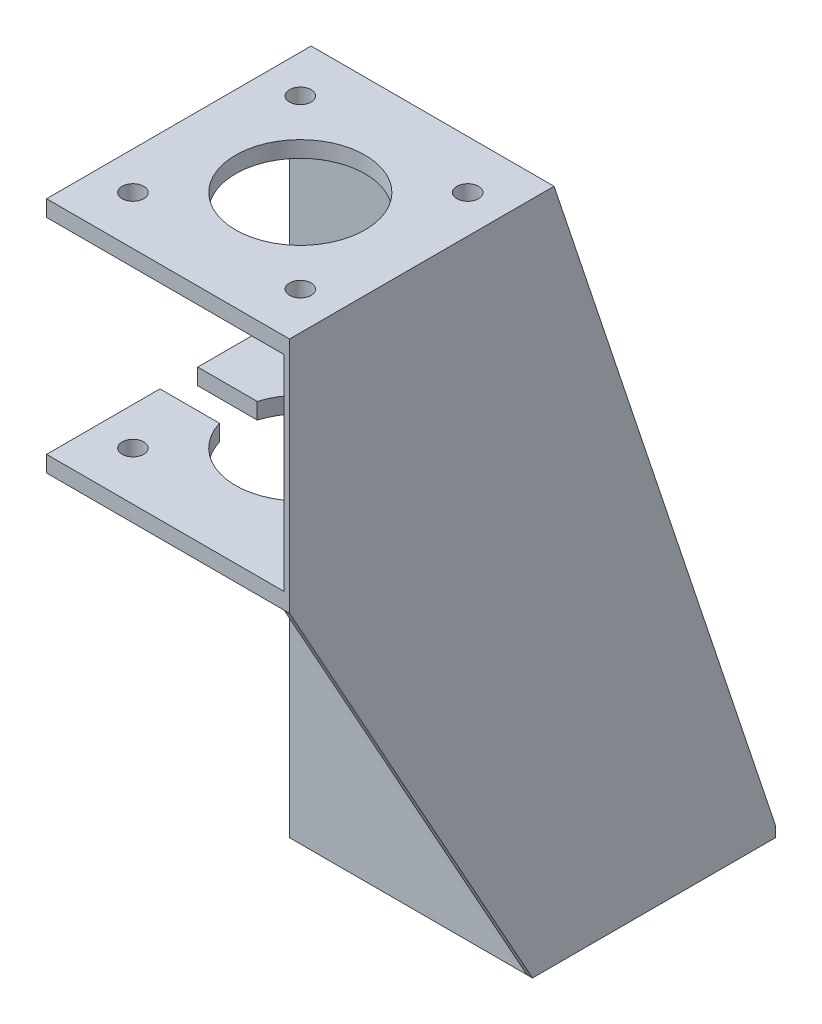
ISO-10303-21;
HEADER;
FILE_DESCRIPTION(('STEP AP214'),'2;1');
FILE_NAME('part.step','',(''),(''),'','','');
FILE_SCHEMA(('AUTOMOTIVE_DESIGN { 1 0 10303 214 1 1 1 1 }'));
ENDSEC;
DATA;
#1=APPLICATION_CONTEXT('core data for automotive mechanical design processes');
#2=APPLICATION_PROTOCOL_DEFINITION('international standard','automotive_design',2000,#1);
#3=PRODUCT_CONTEXT('',#1,'mechanical');
#4=PRODUCT('Part','Part','',(#3));
#5=PRODUCT_RELATED_PRODUCT_CATEGORY('part','',(#4));
#6=PRODUCT_DEFINITION_FORMATION('','',#4);
#7=PRODUCT_DEFINITION_CONTEXT('part definition',#1,'design');
#8=PRODUCT_DEFINITION('design','',#6,#7);
#9=PRODUCT_DEFINITION_SHAPE('','',#8);
#10=(LENGTH_UNIT() NAMED_UNIT(*) SI_UNIT(.MILLI.,.METRE.));
#11=(NAMED_UNIT(*) PLANE_ANGLE_UNIT() SI_UNIT($,.RADIAN.));
#12=(NAMED_UNIT(*) SI_UNIT($,.STERADIAN.) SOLID_ANGLE_UNIT());
#13=UNCERTAINTY_MEASURE_WITH_UNIT(LENGTH_MEASURE(1.E-05),#10,'distance_accuracy_value','');
#14=(GEOMETRIC_REPRESENTATION_CONTEXT(3) GLOBAL_UNCERTAINTY_ASSIGNED_CONTEXT((#13)) GLOBAL_UNIT_ASSIGNED_CONTEXT((#10,
#11,#12)) REPRESENTATION_CONTEXT('',''));
#15=CARTESIAN_POINT('',(0.,0.,0.));
#16=DIRECTION('',(0.,0.,1.));
#17=DIRECTION('',(1.,0.,0.));
#18=AXIS2_PLACEMENT_3D('',#15,#16,#17);
#19=CARTESIAN_POINT('',(-22.5,84.,67.5));
#20=DIRECTION('',(0.,-1.,0.));
#21=DIRECTION('',(0.,0.,-1.));
#22=AXIS2_PLACEMENT_3D('',#19,#20,#21);
#23=PLANE('',#22);
#24=CARTESIAN_POINT('',(-15.5,84.,58.5));
#25=DIRECTION('',(0.,-1.,0.));
#26=DIRECTION('',(0.,0.,-1.));
#27=AXIS2_PLACEMENT_3D('',#24,#25,#26);
#28=CIRCLE('',#27,2.);
#29=CARTESIAN_POINT('',(-15.5,84.,56.5));
#30=VERTEX_POINT('',#29);
#31=EDGE_CURVE('E619',#30,#30,#28,.T.);
#32=ORIENTED_EDGE('',*,*,#31,.T.);
#33=EDGE_LOOP('',(#32));
#34=FACE_BOUND('',#33,.T.);
#35=CARTESIAN_POINT('',(-15.5,84.,27.5));
#36=DIRECTION('',(0.,-1.,0.));
#37=DIRECTION('',(0.,0.,-1.));
#38=AXIS2_PLACEMENT_3D('',#35,#36,#37);
#39=CIRCLE('',#38,2.);
#40=CARTESIAN_POINT('',(-15.5,84.,25.5));
#41=VERTEX_POINT('',#40);
#42=EDGE_CURVE('E623',#41,#41,#39,.T.);
#43=ORIENTED_EDGE('',*,*,#42,.T.);
#44=EDGE_LOOP('',(#43));
#45=FACE_BOUND('',#44,.T.);
#46=CARTESIAN_POINT('',(15.5,84.,27.5));
#47=DIRECTION('',(0.,-1.,0.));
#48=DIRECTION('',(0.,0.,-1.));
#49=AXIS2_PLACEMENT_3D('',#46,#47,#48);
#50=CIRCLE('',#49,2.);
#51=CARTESIAN_POINT('',(15.5,84.,25.5));
#52=VERTEX_POINT('',#51);
#53=EDGE_CURVE('E627',#52,#52,#50,.T.);
#54=ORIENTED_EDGE('',*,*,#53,.T.);
#55=EDGE_LOOP('',(#54));
#56=FACE_BOUND('',#55,.T.);
#57=CARTESIAN_POINT('',(15.5,84.,58.5));
#58=DIRECTION('',(0.,-1.,0.));
#59=DIRECTION('',(0.,0.,-1.));
#60=AXIS2_PLACEMENT_3D('',#57,#58,#59);
#61=CIRCLE('',#60,2.00000000000001);
#62=CARTESIAN_POINT('',(15.5,84.,56.5));
#63=VERTEX_POINT('',#62);
#64=EDGE_CURVE('E630',#63,#63,#61,.T.);
#65=ORIENTED_EDGE('',*,*,#64,.T.);
#66=EDGE_LOOP('',(#65));
#67=FACE_BOUND('',#66,.T.);
#68=DIRECTION('',(0.,0.,-1.));
#69=VECTOR('',#68,1.);
#70=CARTESIAN_POINT('',(21.5,84.,67.5));
#71=LINE('',#70,#69);
#72=CARTESIAN_POINT('',(21.5,84.,67.5));
#73=VERTEX_POINT('',#72);
#74=CARTESIAN_POINT('',(21.5,84.,22.5));
#75=VERTEX_POINT('',#74);
#76=EDGE_CURVE('E62',#73,#75,#71,.T.);
#77=ORIENTED_EDGE('',*,*,#76,.T.);
#78=DIRECTION('',(-1.,0.,0.));
#79=VECTOR('',#78,1.);
#80=CARTESIAN_POINT('',(-22.5,84.,22.5));
#81=LINE('',#80,#79);
#82=CARTESIAN_POINT('',(-22.5,84.,22.5));
#83=VERTEX_POINT('',#82);
#84=EDGE_CURVE('E249',#75,#83,#81,.T.);
#85=ORIENTED_EDGE('',*,*,#84,.T.);
#86=DIRECTION('',(0.,0.,-1.));
#87=VECTOR('',#86,1.);
#88=CARTESIAN_POINT('',(-22.5,84.,67.5));
#89=LINE('',#88,#87);
#90=CARTESIAN_POINT('',(-22.5,84.,39.5));
#91=VERTEX_POINT('',#90);
#92=EDGE_CURVE('E247',#91,#83,#89,.T.);
#93=ORIENTED_EDGE('',*,*,#92,.F.);
#94=DIRECTION('',(1.,0.,0.));
#95=VECTOR('',#94,1.);
#96=CARTESIAN_POINT('',(-36.4498340359898,84.,39.5));
#97=LINE('',#96,#95);
#98=CARTESIAN_POINT('',(-11.478240283249,84.,39.5));
#99=VERTEX_POINT('',#98);
#100=EDGE_CURVE('E603',#91,#99,#97,.T.);
#101=ORIENTED_EDGE('',*,*,#100,.T.);
#102=CARTESIAN_POINT('',(0.,84.,43.));
#103=DIRECTION('',(0.,-1.,0.));
#104=DIRECTION('',(0.,0.,-1.));
#105=AXIS2_PLACEMENT_3D('',#102,#103,#104);
#106=CIRCLE('',#105,12.);
#107=CARTESIAN_POINT('',(-11.478240283249,84.,46.5));
#108=VERTEX_POINT('',#107);
#109=EDGE_CURVE('E254',#99,#108,#106,.T.);
#110=ORIENTED_EDGE('',*,*,#109,.T.);
#111=DIRECTION('',(1.,0.,0.));
#112=VECTOR('',#111,1.);
#113=CARTESIAN_POINT('',(-36.4498340359898,84.,46.5));
#114=LINE('',#113,#112);
#115=CARTESIAN_POINT('',(-22.5,84.,46.5));
#116=VERTEX_POINT('',#115);
#117=EDGE_CURVE('E597',#116,#108,#114,.T.);
#118=ORIENTED_EDGE('',*,*,#117,.F.);
#119=CARTESIAN_POINT('',(-22.5,84.,67.5));
#120=VERTEX_POINT('',#119);
#121=EDGE_CURVE('E256',#120,#116,#89,.T.);
#122=ORIENTED_EDGE('',*,*,#121,.F.);
#123=DIRECTION('',(-1.,0.,0.));
#124=VECTOR('',#123,1.);
#125=CARTESIAN_POINT('',(-22.5,84.,67.5));
#126=LINE('',#125,#124);
#127=EDGE_CURVE('E245',#73,#120,#126,.T.);
#128=ORIENTED_EDGE('',*,*,#127,.F.);
#129=EDGE_LOOP('',(#77,#85,#93,#101,#110,#118,#122,#128));
#130=FACE_BOUND('',#129,.T.);
#131=ADVANCED_FACE('F37',(#34,#45,#56,#67,#130),#23,.F.);
#132=CARTESIAN_POINT('',(-22.5,2.,22.5));
#133=DIRECTION('',(0.,0.,-1.));
#134=DIRECTION('',(-1.,0.,0.));
#135=AXIS2_PLACEMENT_3D('',#132,#133,#134);
#136=PLANE('',#135);
#137=DIRECTION('',(0.,-1.,0.));
#138=VECTOR('',#137,1.);
#139=CARTESIAN_POINT('',(21.5,2.,22.5));
#140=LINE('',#139,#138);
#141=CARTESIAN_POINT('',(21.5,122.,22.5));
#142=VERTEX_POINT('',#141);
#143=EDGE_CURVE('E595',#142,#75,#140,.T.);
#144=ORIENTED_EDGE('',*,*,#143,.F.);
#145=DIRECTION('',(1.,0.,0.));
#146=VECTOR('',#145,1.);
#147=CARTESIAN_POINT('',(-22.5,122.,22.5));
#148=LINE('',#147,#146);
#149=CARTESIAN_POINT('',(-22.5,122.,22.5));
#150=VERTEX_POINT('',#149);
#151=EDGE_CURVE('E292',#150,#142,#148,.T.);
#152=ORIENTED_EDGE('',*,*,#151,.F.);
#153=DIRECTION('',(0.,-1.,0.));
#154=VECTOR('',#153,1.);
#155=CARTESIAN_POINT('',(-22.5,2.,22.5));
#156=LINE('',#155,#154);
#157=EDGE_CURVE('E312',#150,#83,#156,.T.);
#158=ORIENTED_EDGE('',*,*,#157,.T.);
#159=ORIENTED_EDGE('',*,*,#84,.F.);
#160=EDGE_LOOP('',(#144,#152,#158,#159));
#161=FACE_BOUND('',#160,.T.);
#162=ADVANCED_FACE('F490',(#161),#136,.F.);
#163=CARTESIAN_POINT('',(-22.5,122.,67.5));
#164=DIRECTION('',(0.,1.,0.));
#165=DIRECTION('',(0.,0.,1.));
#166=AXIS2_PLACEMENT_3D('',#163,#164,#165);
#167=PLANE('',#166);
#168=CARTESIAN_POINT('',(-15.5,122.,27.5));
#169=DIRECTION('',(0.,1.,0.));
#170=DIRECTION('',(0.,0.,1.));
#171=AXIS2_PLACEMENT_3D('',#168,#169,#170);
#172=CIRCLE('',#171,2.);
#173=CARTESIAN_POINT('',(-15.5,122.,29.5));
#174=VERTEX_POINT('',#173);
#175=EDGE_CURVE('E289',#174,#174,#172,.F.);
#176=ORIENTED_EDGE('',*,*,#175,.F.);
#177=EDGE_LOOP('',(#176));
#178=FACE_BOUND('',#177,.T.);
#179=CARTESIAN_POINT('',(-15.5,122.,58.5));
#180=DIRECTION('',(0.,1.,0.));
#181=DIRECTION('',(0.,0.,1.));
#182=AXIS2_PLACEMENT_3D('',#179,#180,#181);
#183=CIRCLE('',#182,2.);
#184=CARTESIAN_POINT('',(-15.5,122.,60.5));
#185=VERTEX_POINT('',#184);
#186=EDGE_CURVE('E280',#185,#185,#183,.F.);
#187=ORIENTED_EDGE('',*,*,#186,.F.);
#188=EDGE_LOOP('',(#187));
#189=FACE_BOUND('',#188,.T.);
#190=CARTESIAN_POINT('',(0.,122.,43.));
#191=DIRECTION('',(0.,1.,0.));
#192=DIRECTION('',(0.,0.,1.));
#193=AXIS2_PLACEMENT_3D('',#190,#191,#192);
#194=CIRCLE('',#193,12.);
#195=CARTESIAN_POINT('',(0.,122.,55.));
#196=VERTEX_POINT('',#195);
#197=EDGE_CURVE('E274',#196,#196,#194,.F.);
#198=ORIENTED_EDGE('',*,*,#197,.F.);
#199=EDGE_LOOP('',(#198));
#200=FACE_BOUND('',#199,.T.);
#201=CARTESIAN_POINT('',(15.5,122.,58.5));
#202=DIRECTION('',(0.,1.,0.));
#203=DIRECTION('',(0.,0.,1.));
#204=AXIS2_PLACEMENT_3D('',#201,#202,#203);
#205=CIRCLE('',#204,2.);
#206=CARTESIAN_POINT('',(15.5,122.,60.5));
#207=VERTEX_POINT('',#206);
#208=EDGE_CURVE('E268',#207,#207,#205,.F.);
#209=ORIENTED_EDGE('',*,*,#208,.F.);
#210=EDGE_LOOP('',(#209));
#211=FACE_BOUND('',#210,.T.);
#212=CARTESIAN_POINT('',(15.5,122.,27.5));
#213=DIRECTION('',(0.,1.,0.));
#214=DIRECTION('',(0.,0.,1.));
#215=AXIS2_PLACEMENT_3D('',#212,#213,#214);
#216=CIRCLE('',#215,2.);
#217=CARTESIAN_POINT('',(15.5,122.,29.5));
#218=VERTEX_POINT('',#217);
#219=EDGE_CURVE('E262',#218,#218,#216,.F.);
#220=ORIENTED_EDGE('',*,*,#219,.F.);
#221=EDGE_LOOP('',(#220));
#222=FACE_BOUND('',#221,.T.);
#223=DIRECTION('',(0.,0.,-1.));
#224=VECTOR('',#223,1.);
#225=CARTESIAN_POINT('',(21.5,122.,67.5));
#226=LINE('',#225,#224);
#227=CARTESIAN_POINT('',(21.5,122.,67.5));
#228=VERTEX_POINT('',#227);
#229=EDGE_CURVE('E593',#228,#142,#226,.T.);
#230=ORIENTED_EDGE('',*,*,#229,.F.);
#231=DIRECTION('',(1.,0.,0.));
#232=VECTOR('',#231,1.);
#233=CARTESIAN_POINT('',(-22.5,122.,67.5));
#234=LINE('',#233,#232);
#235=CARTESIAN_POINT('',(-22.5,122.,67.5));
#236=VERTEX_POINT('',#235);
#237=EDGE_CURVE('E296',#236,#228,#234,.T.);
#238=ORIENTED_EDGE('',*,*,#237,.F.);
#239=DIRECTION('',(0.,0.,-1.));
#240=VECTOR('',#239,1.);
#241=CARTESIAN_POINT('',(-22.5,122.,67.5));
#242=LINE('',#241,#240);
#243=EDGE_CURVE('E303',#236,#150,#242,.T.);
#244=ORIENTED_EDGE('',*,*,#243,.T.);
#245=ORIENTED_EDGE('',*,*,#151,.T.);
#246=EDGE_LOOP('',(#230,#238,#244,#245));
#247=FACE_BOUND('',#246,.T.);
#248=ADVANCED_FACE('F496',(#178,#189,#200,#211,#222,#247),#167,.F.);
#249=CARTESIAN_POINT('',(-22.5,2.,-22.5));
#250=DIRECTION('',(1.,0.,0.));
#251=DIRECTION('',(0.,0.,-1.));
#252=AXIS2_PLACEMENT_3D('',#249,#250,#251);
#253=PLANE('',#252);
#254=DIRECTION('',(0.,-1.,0.));
#255=VECTOR('',#254,1.);
#256=CARTESIAN_POINT('',(-22.5,2.,39.5));
#257=LINE('',#256,#255);
#258=CARTESIAN_POINT('',(-22.5,81.,39.5));
#259=VERTEX_POINT('',#258);
#260=EDGE_CURVE('E614',#91,#259,#257,.T.);
#261=ORIENTED_EDGE('',*,*,#260,.F.);
#262=ORIENTED_EDGE('',*,*,#92,.T.);
#263=ORIENTED_EDGE('',*,*,#157,.F.);
#264=ORIENTED_EDGE('',*,*,#243,.F.);
#265=DIRECTION('',(0.,-1.,0.));
#266=VECTOR('',#265,1.);
#267=CARTESIAN_POINT('',(-22.5,125.,67.5));
#268=LINE('',#267,#266);
#269=CARTESIAN_POINT('',(-22.5,125.,67.5));
#270=VERTEX_POINT('',#269);
#271=EDGE_CURVE('E293',#270,#236,#268,.T.);
#272=ORIENTED_EDGE('',*,*,#271,.F.);
#273=DIRECTION('',(0.,0.,1.));
#274=VECTOR('',#273,1.);
#275=CARTESIAN_POINT('',(-22.5,125.,18.5));
#276=LINE('',#275,#274);
#277=CARTESIAN_POINT('',(-22.5,125.,18.5));
#278=VERTEX_POINT('',#277);
#279=EDGE_CURVE('E389',#278,#270,#276,.T.);
#280=ORIENTED_EDGE('',*,*,#279,.F.);
#281=DIRECTION('',(0.,-1.,0.));
#282=VECTOR('',#281,1.);
#283=CARTESIAN_POINT('',(-22.5,122.,18.5));
#284=LINE('',#283,#282);
#285=CARTESIAN_POINT('',(-22.5,2.,18.5));
#286=VERTEX_POINT('',#285);
#287=EDGE_CURVE('E340',#278,#286,#284,.T.);
#288=ORIENTED_EDGE('',*,*,#287,.T.);
#289=DIRECTION('',(0.,0.,1.));
#290=VECTOR('',#289,1.);
#291=CARTESIAN_POINT('',(-22.5,2.,-22.5));
#292=LINE('',#291,#290);
#293=CARTESIAN_POINT('',(-22.5,2.,-22.5));
#294=VERTEX_POINT('',#293);
#295=EDGE_CURVE('E322',#294,#286,#292,.T.);
#296=ORIENTED_EDGE('',*,*,#295,.F.);
#297=DIRECTION('',(0.,-1.,0.));
#298=VECTOR('',#297,1.);
#299=CARTESIAN_POINT('',(-22.5,2.,-22.5));
#300=LINE('',#299,#298);
#301=CARTESIAN_POINT('',(-22.5,0.,-22.5));
#302=VERTEX_POINT('',#301);
#303=EDGE_CURVE('E329',#294,#302,#300,.T.);
#304=ORIENTED_EDGE('',*,*,#303,.T.);
#305=DIRECTION('',(0.,0.,1.));
#306=VECTOR('',#305,1.);
#307=CARTESIAN_POINT('',(-22.5,0.,-22.5));
#308=LINE('',#307,#306);
#309=CARTESIAN_POINT('',(-22.5,0.,22.5));
#310=VERTEX_POINT('',#309);
#311=EDGE_CURVE('E350',#302,#310,#308,.T.);
#312=ORIENTED_EDGE('',*,*,#311,.T.);
#313=CARTESIAN_POINT('',(-22.5,81.,22.5));
#314=VERTEX_POINT('',#313);
#315=EDGE_CURVE('E320',#314,#310,#156,.T.);
#316=ORIENTED_EDGE('',*,*,#315,.F.);
#317=DIRECTION('',(0.,0.,-1.));
#318=VECTOR('',#317,1.);
#319=CARTESIAN_POINT('',(-22.5,81.,67.5));
#320=LINE('',#319,#318);
#321=EDGE_CURVE('E259',#259,#314,#320,.T.);
#322=ORIENTED_EDGE('',*,*,#321,.F.);
#323=EDGE_LOOP('',(#261,#262,#263,#264,#272,#280,#288,#296,#304,#312,#316,#322));
#324=FACE_BOUND('',#323,.T.);
#325=ADVANCED_FACE('F384',(#324),#253,.F.);
#326=CARTESIAN_POINT('',(-22.5,81.,67.5));
#327=DIRECTION('',(0.,1.,0.));
#328=DIRECTION('',(0.,0.,1.));
#329=AXIS2_PLACEMENT_3D('',#326,#327,#328);
#330=PLANE('',#329);
#331=CARTESIAN_POINT('',(15.5,81.,58.5));
#332=DIRECTION('',(0.,1.,0.));
#333=DIRECTION('',(0.,0.,1.));
#334=AXIS2_PLACEMENT_3D('',#331,#332,#333);
#335=CIRCLE('',#334,2.00000000000001);
#336=CARTESIAN_POINT('',(15.5,81.,60.5));
#337=VERTEX_POINT('',#336);
#338=EDGE_CURVE('E628',#337,#337,#335,.F.);
#339=ORIENTED_EDGE('',*,*,#338,.F.);
#340=EDGE_LOOP('',(#339));
#341=FACE_BOUND('',#340,.T.);
#342=CARTESIAN_POINT('',(15.5,81.,27.5));
#343=DIRECTION('',(0.,1.,0.));
#344=DIRECTION('',(0.,0.,1.));
#345=AXIS2_PLACEMENT_3D('',#342,#343,#344);
#346=CIRCLE('',#345,2.);
#347=CARTESIAN_POINT('',(15.5,81.,29.5));
#348=VERTEX_POINT('',#347);
#349=EDGE_CURVE('E624',#348,#348,#346,.F.);
#350=ORIENTED_EDGE('',*,*,#349,.F.);
#351=EDGE_LOOP('',(#350));
#352=FACE_BOUND('',#351,.T.);
#353=CARTESIAN_POINT('',(-15.5,81.,27.5));
#354=DIRECTION('',(0.,1.,0.));
#355=DIRECTION('',(0.,0.,1.));
#356=AXIS2_PLACEMENT_3D('',#353,#354,#355);
#357=CIRCLE('',#356,2.);
#358=CARTESIAN_POINT('',(-15.5,81.,29.5));
#359=VERTEX_POINT('',#358);
#360=EDGE_CURVE('E620',#359,#359,#357,.F.);
#361=ORIENTED_EDGE('',*,*,#360,.F.);
#362=EDGE_LOOP('',(#361));
#363=FACE_BOUND('',#362,.T.);
#364=CARTESIAN_POINT('',(-15.5,81.,58.5));
#365=DIRECTION('',(0.,1.,0.));
#366=DIRECTION('',(0.,0.,1.));
#367=AXIS2_PLACEMENT_3D('',#364,#365,#366);
#368=CIRCLE('',#367,2.);
#369=CARTESIAN_POINT('',(-15.5,81.,60.5));
#370=VERTEX_POINT('',#369);
#371=EDGE_CURVE('E616',#370,#370,#368,.F.);
#372=ORIENTED_EDGE('',*,*,#371,.F.);
#373=EDGE_LOOP('',(#372));
#374=FACE_BOUND('',#373,.T.);
#375=DIRECTION('',(1.,0.,0.));
#376=VECTOR('',#375,1.);
#377=CARTESIAN_POINT('',(-22.5,81.,22.5));
#378=LINE('',#377,#376);
#379=CARTESIAN_POINT('',(21.5,81.,22.5));
#380=VERTEX_POINT('',#379);
#381=EDGE_CURVE('E238',#314,#380,#378,.T.);
#382=ORIENTED_EDGE('',*,*,#381,.T.);
#383=DIRECTION('',(0.,0.,1.));
#384=VECTOR('',#383,1.);
#385=CARTESIAN_POINT('',(21.5,81.,67.5));
#386=LINE('',#385,#384);
#387=CARTESIAN_POINT('',(21.5,81.,67.5));
#388=VERTEX_POINT('',#387);
#389=EDGE_CURVE('E228',#380,#388,#386,.T.);
#390=ORIENTED_EDGE('',*,*,#389,.T.);
#391=DIRECTION('',(1.,0.,0.));
#392=VECTOR('',#391,1.);
#393=CARTESIAN_POINT('',(-22.5,81.,67.5));
#394=LINE('',#393,#392);
#395=CARTESIAN_POINT('',(-22.5,81.,67.5));
#396=VERTEX_POINT('',#395);
#397=EDGE_CURVE('E235',#396,#388,#394,.T.);
#398=ORIENTED_EDGE('',*,*,#397,.F.);
#399=CARTESIAN_POINT('',(-22.5,81.,46.5));
#400=VERTEX_POINT('',#399);
#401=EDGE_CURVE('E260',#396,#400,#320,.T.);
#402=ORIENTED_EDGE('',*,*,#401,.T.);
#403=DIRECTION('',(1.,0.,0.));
#404=VECTOR('',#403,1.);
#405=CARTESIAN_POINT('',(-22.5,81.,46.5));
#406=LINE('',#405,#404);
#407=CARTESIAN_POINT('',(-11.478240283249,81.,46.5));
#408=VERTEX_POINT('',#407);
#409=EDGE_CURVE('E606',#400,#408,#406,.T.);
#410=ORIENTED_EDGE('',*,*,#409,.T.);
#411=CARTESIAN_POINT('',(0.,81.,43.));
#412=DIRECTION('',(0.,1.,0.));
#413=DIRECTION('',(0.,0.,1.));
#414=AXIS2_PLACEMENT_3D('',#411,#412,#413);
#415=CIRCLE('',#414,12.);
#416=CARTESIAN_POINT('',(-11.478240283249,81.,39.5));
#417=VERTEX_POINT('',#416);
#418=EDGE_CURVE('E631',#417,#408,#415,.F.);
#419=ORIENTED_EDGE('',*,*,#418,.F.);
#420=DIRECTION('',(1.,0.,0.));
#421=VECTOR('',#420,1.);
#422=CARTESIAN_POINT('',(-22.5,81.,39.5));
#423=LINE('',#422,#421);
#424=EDGE_CURVE('E612',#259,#417,#423,.T.);
#425=ORIENTED_EDGE('',*,*,#424,.F.);
#426=ORIENTED_EDGE('',*,*,#321,.T.);
#427=EDGE_LOOP('',(#382,#390,#398,#402,#410,#419,#425,#426));
#428=FACE_BOUND('',#427,.T.);
#429=ADVANCED_FACE('F233',(#341,#352,#363,#374,#428),#330,.F.);
#430=CARTESIAN_POINT('',(0.,47.0588745030457,43.));
#431=DIRECTION('',(0.,1.,0.));
#432=DIRECTION('',(0.,0.,1.));
#433=AXIS2_PLACEMENT_3D('',#430,#431,#432);
#434=CYLINDRICAL_SURFACE('',#433,12.);
#435=DIRECTION('',(0.,1.,0.));
#436=VECTOR('',#435,1.);
#437=CARTESIAN_POINT('',(-11.478240283249,47.0588745030457,39.5));
#438=LINE('',#437,#436);
#439=EDGE_CURVE('E11',#417,#99,#438,.T.);
#440=ORIENTED_EDGE('',*,*,#439,.F.);
#441=ORIENTED_EDGE('',*,*,#418,.T.);
#442=DIRECTION('',(0.,1.,0.));
#443=VECTOR('',#442,1.);
#444=CARTESIAN_POINT('',(-11.478240283249,47.0588745030457,46.5));
#445=LINE('',#444,#443);
#446=EDGE_CURVE('E47',#408,#108,#445,.T.);
#447=ORIENTED_EDGE('',*,*,#446,.T.);
#448=ORIENTED_EDGE('',*,*,#109,.F.);
#449=EDGE_LOOP('',(#440,#441,#447,#448));
#450=FACE_BOUND('',#449,.T.);
#451=ADVANCED_FACE('F504',(#450),#434,.F.);
#452=DIRECTION('',(1.,0.,0.));
#453=VECTOR('',#452,1.);
#454=CARTESIAN_POINT('',(-22.5,0.,22.5));
#455=LINE('',#454,#453);
#456=CARTESIAN_POINT('',(21.5,0.,22.5));
#457=VERTEX_POINT('',#456);
#458=EDGE_CURVE('E327',#310,#457,#455,.T.);
#459=ORIENTED_EDGE('',*,*,#458,.T.);
#460=DIRECTION('',(0.,1.,0.));
#461=VECTOR('',#460,1.);
#462=CARTESIAN_POINT('',(21.5,0.,22.5));
#463=LINE('',#462,#461);
#464=EDGE_CURVE('E223',#457,#380,#463,.T.);
#465=ORIENTED_EDGE('',*,*,#464,.T.);
#466=ORIENTED_EDGE('',*,*,#381,.F.);
#467=ORIENTED_EDGE('',*,*,#315,.T.);
#468=EDGE_LOOP('',(#459,#465,#466,#467));
#469=FACE_BOUND('',#468,.T.);
#470=ADVANCED_FACE('F499',(#469),#136,.F.);
#471=CARTESIAN_POINT('',(22.5,2.,-22.5));
#472=DIRECTION('',(-1.,0.,0.));
#473=DIRECTION('',(0.,0.,1.));
#474=AXIS2_PLACEMENT_3D('',#471,#472,#473);
#475=PLANE('',#474);
#476=DIRECTION('',(0.,0.,-1.));
#477=VECTOR('',#476,1.);
#478=CARTESIAN_POINT('',(22.5,125.,22.5));
#479=LINE('',#478,#477);
#480=CARTESIAN_POINT('',(22.5,125.,67.5));
#481=VERTEX_POINT('',#480);
#482=CARTESIAN_POINT('',(22.5,125.,18.5));
#483=VERTEX_POINT('',#482);
#484=EDGE_CURVE('E394',#481,#483,#479,.T.);
#485=ORIENTED_EDGE('',*,*,#484,.F.);
#486=DIRECTION('',(0.,1.,0.));
#487=VECTOR('',#486,1.);
#488=CARTESIAN_POINT('',(22.5,125.,67.5));
#489=LINE('',#488,#487);
#490=CARTESIAN_POINT('',(22.5,81.,67.5));
#491=VERTEX_POINT('',#490);
#492=EDGE_CURVE('E299',#491,#481,#489,.T.);
#493=ORIENTED_EDGE('',*,*,#492,.F.);
#494=DIRECTION('',(0.,-0.874157276121538,-0.485642931178632));
#495=VECTOR('',#494,1.);
#496=CARTESIAN_POINT('',(22.5,81.,67.5));
#497=LINE('',#496,#495);
#498=CARTESIAN_POINT('',(22.5,0.,22.5));
#499=VERTEX_POINT('',#498);
#500=EDGE_CURVE('E218',#491,#499,#497,.T.);
#501=ORIENTED_EDGE('',*,*,#500,.T.);
#502=DIRECTION('',(0.,0.,-1.));
#503=VECTOR('',#502,1.);
#504=CARTESIAN_POINT('',(22.5,0.,-22.5));
#505=LINE('',#504,#503);
#506=CARTESIAN_POINT('',(22.5,0.,-22.5));
#507=VERTEX_POINT('',#506);
#508=EDGE_CURVE('E345',#499,#507,#505,.T.);
#509=ORIENTED_EDGE('',*,*,#508,.T.);
#510=DIRECTION('',(0.,-1.,0.));
#511=VECTOR('',#510,1.);
#512=CARTESIAN_POINT('',(22.5,2.,-22.5));
#513=LINE('',#512,#511);
#514=CARTESIAN_POINT('',(22.5,2.,-22.5));
#515=VERTEX_POINT('',#514);
#516=EDGE_CURVE('E333',#515,#507,#513,.T.);
#517=ORIENTED_EDGE('',*,*,#516,.F.);
#518=DIRECTION('',(0.,0.948683298050514,0.316227766016838));
#519=VECTOR('',#518,1.);
#520=CARTESIAN_POINT('',(22.5,125.,18.5));
#521=LINE('',#520,#519);
#522=EDGE_CURVE('E239',#515,#483,#521,.T.);
#523=ORIENTED_EDGE('',*,*,#522,.T.);
#524=EDGE_LOOP('',(#485,#493,#501,#509,#517,#523));
#525=FACE_BOUND('',#524,.T.);
#526=ADVANCED_FACE('F39',(#525),#475,.F.);
#527=CARTESIAN_POINT('',(-22.5,2.,-22.5));
#528=DIRECTION('',(0.,0.,1.));
#529=DIRECTION('',(1.,0.,0.));
#530=AXIS2_PLACEMENT_3D('',#527,#528,#529);
#531=PLANE('',#530);
#532=DIRECTION('',(-1.,0.,0.));
#533=VECTOR('',#532,1.);
#534=CARTESIAN_POINT('',(-22.5,2.,-22.5));
#535=LINE('',#534,#533);
#536=CARTESIAN_POINT('',(21.5,2.,-22.5));
#537=VERTEX_POINT('',#536);
#538=EDGE_CURVE('E357',#537,#294,#535,.T.);
#539=ORIENTED_EDGE('',*,*,#538,.F.);
#540=EDGE_CURVE('E339',#515,#537,#535,.T.);
#541=ORIENTED_EDGE('',*,*,#540,.F.);
#542=ORIENTED_EDGE('',*,*,#516,.T.);
#543=DIRECTION('',(-1.,0.,0.));
#544=VECTOR('',#543,1.);
#545=CARTESIAN_POINT('',(-22.5,0.,-22.5));
#546=LINE('',#545,#544);
#547=EDGE_CURVE('E348',#507,#302,#546,.T.);
#548=ORIENTED_EDGE('',*,*,#547,.T.);
#549=ORIENTED_EDGE('',*,*,#303,.F.);
#550=EDGE_LOOP('',(#539,#541,#542,#548,#549));
#551=FACE_BOUND('',#550,.T.);
#552=ADVANCED_FACE('F380',(#551),#531,.F.);
#553=ORIENTED_EDGE('',*,*,#121,.T.);
#554=DIRECTION('',(0.,-1.,0.));
#555=VECTOR('',#554,1.);
#556=CARTESIAN_POINT('',(-22.5,2.,46.5));
#557=LINE('',#556,#555);
#558=EDGE_CURVE('E609',#116,#400,#557,.T.);
#559=ORIENTED_EDGE('',*,*,#558,.T.);
#560=ORIENTED_EDGE('',*,*,#401,.F.);
#561=DIRECTION('',(0.,-1.,0.));
#562=VECTOR('',#561,1.);
#563=CARTESIAN_POINT('',(-22.5,84.,67.5));
#564=LINE('',#563,#562);
#565=EDGE_CURVE('E243',#120,#396,#564,.T.);
#566=ORIENTED_EDGE('',*,*,#565,.F.);
#567=EDGE_LOOP('',(#553,#559,#560,#566));
#568=FACE_BOUND('',#567,.T.);
#569=ADVANCED_FACE('F573',(#568),#253,.F.);
#570=CARTESIAN_POINT('',(0.,2.,0.));
#571=DIRECTION('',(0.,1.,0.));
#572=DIRECTION('',(0.,0.,1.));
#573=AXIS2_PLACEMENT_3D('',#570,#571,#572);
#574=PLANE('',#573);
#575=DIRECTION('',(0.,0.,1.));
#576=VECTOR('',#575,1.);
#577=CARTESIAN_POINT('',(21.5,2.,0.));
#578=LINE('',#577,#576);
#579=CARTESIAN_POINT('',(21.5,2.,18.5));
#580=VERTEX_POINT('',#579);
#581=EDGE_CURVE('E370',#537,#580,#578,.T.);
#582=ORIENTED_EDGE('',*,*,#581,.F.);
#583=ORIENTED_EDGE('',*,*,#538,.T.);
#584=ORIENTED_EDGE('',*,*,#295,.T.);
#585=DIRECTION('',(-1.,0.,0.));
#586=VECTOR('',#585,1.);
#587=CARTESIAN_POINT('',(-22.5,2.,18.5));
#588=LINE('',#587,#586);
#589=EDGE_CURVE('E41',#580,#286,#588,.T.);
#590=ORIENTED_EDGE('',*,*,#589,.F.);
#591=EDGE_LOOP('',(#582,#583,#584,#590));
#592=FACE_BOUND('',#591,.T.);
#593=CARTESIAN_POINT('',(15.,2.,14.6920775508223));
#594=DIRECTION('',(0.,1.,0.));
#595=DIRECTION('',(0.,0.,-1.));
#596=AXIS2_PLACEMENT_3D('',#593,#594,#595);
#597=CIRCLE('',#596,3.);
#598=CARTESIAN_POINT('',(12.,2.,14.6920775508223));
#599=VERTEX_POINT('',#598);
#600=CARTESIAN_POINT('',(18.,2.,14.6920775508223));
#601=VERTEX_POINT('',#600);
#602=EDGE_CURVE('E391',#599,#601,#597,.T.);
#603=ORIENTED_EDGE('',*,*,#602,.F.);
#604=DIRECTION('',(0.,0.,1.));
#605=VECTOR('',#604,1.);
#606=CARTESIAN_POINT('',(12.,2.,14.6920775508223));
#607=LINE('',#606,#605);
#608=CARTESIAN_POINT('',(12.,2.,-15.3079224491777));
#609=VERTEX_POINT('',#608);
#610=EDGE_CURVE('E406',#609,#599,#607,.T.);
#611=ORIENTED_EDGE('',*,*,#610,.F.);
#612=CARTESIAN_POINT('',(15.,2.,-15.3079224491777));
#613=DIRECTION('',(0.,1.,0.));
#614=DIRECTION('',(0.,0.,-1.));
#615=AXIS2_PLACEMENT_3D('',#612,#613,#614);
#616=CIRCLE('',#615,3.);
#617=CARTESIAN_POINT('',(18.,2.,-15.3079224491777));
#618=VERTEX_POINT('',#617);
#619=EDGE_CURVE('E418',#618,#609,#616,.T.);
#620=ORIENTED_EDGE('',*,*,#619,.F.);
#621=DIRECTION('',(0.,0.,-1.));
#622=VECTOR('',#621,1.);
#623=CARTESIAN_POINT('',(18.,2.,14.6920775508223));
#624=LINE('',#623,#622);
#625=EDGE_CURVE('E392',#601,#618,#624,.T.);
#626=ORIENTED_EDGE('',*,*,#625,.F.);
#627=EDGE_LOOP('',(#603,#611,#620,#626));
#628=FACE_BOUND('',#627,.T.);
#629=CARTESIAN_POINT('',(-15.,2.,14.6920775508223));
#630=DIRECTION('',(0.,1.,0.));
#631=DIRECTION('',(0.,0.,1.));
#632=AXIS2_PLACEMENT_3D('',#629,#630,#631);
#633=CIRCLE('',#632,3.);
#634=CARTESIAN_POINT('',(-18.,2.,14.6920775508223));
#635=VERTEX_POINT('',#634);
#636=CARTESIAN_POINT('',(-12.,2.,14.6920775508223));
#637=VERTEX_POINT('',#636);
#638=EDGE_CURVE('E425',#635,#637,#633,.T.);
#639=ORIENTED_EDGE('',*,*,#638,.F.);
#640=DIRECTION('',(0.,0.,1.));
#641=VECTOR('',#640,1.);
#642=CARTESIAN_POINT('',(-18.,2.,14.6920775508223));
#643=LINE('',#642,#641);
#644=CARTESIAN_POINT('',(-18.,2.,-15.3079224491777));
#645=VERTEX_POINT('',#644);
#646=EDGE_CURVE('E436',#645,#635,#643,.T.);
#647=ORIENTED_EDGE('',*,*,#646,.F.);
#648=CARTESIAN_POINT('',(-15.,2.,-15.3079224491777));
#649=DIRECTION('',(0.,1.,0.));
#650=DIRECTION('',(0.,0.,1.));
#651=AXIS2_PLACEMENT_3D('',#648,#649,#650);
#652=CIRCLE('',#651,3.);
#653=CARTESIAN_POINT('',(-12.,2.,-15.3079224491777));
#654=VERTEX_POINT('',#653);
#655=EDGE_CURVE('E450',#654,#645,#652,.T.);
#656=ORIENTED_EDGE('',*,*,#655,.F.);
#657=DIRECTION('',(0.,0.,-1.));
#658=VECTOR('',#657,1.);
#659=CARTESIAN_POINT('',(-12.,2.,14.6920775508223));
#660=LINE('',#659,#658);
#661=EDGE_CURVE('E447',#637,#654,#660,.T.);
#662=ORIENTED_EDGE('',*,*,#661,.F.);
#663=EDGE_LOOP('',(#639,#647,#656,#662));
#664=FACE_BOUND('',#663,.T.);
#665=ADVANCED_FACE('F376',(#592,#628,#664),#574,.T.);
#666=CARTESIAN_POINT('',(0.,0.,0.));
#667=DIRECTION('',(0.,1.,0.));
#668=DIRECTION('',(0.,0.,1.));
#669=AXIS2_PLACEMENT_3D('',#666,#667,#668);
#670=PLANE('',#669);
#671=DIRECTION('',(0.,0.,1.));
#672=VECTOR('',#671,1.);
#673=CARTESIAN_POINT('',(12.,0.,14.6920775508223));
#674=LINE('',#673,#672);
#675=CARTESIAN_POINT('',(12.,0.,-15.3079224491777));
#676=VERTEX_POINT('',#675);
#677=CARTESIAN_POINT('',(12.,0.,14.6920775508223));
#678=VERTEX_POINT('',#677);
#679=EDGE_CURVE('E412',#676,#678,#674,.T.);
#680=ORIENTED_EDGE('',*,*,#679,.T.);
#681=CARTESIAN_POINT('',(15.,0.,14.6920775508223));
#682=DIRECTION('',(0.,1.,0.));
#683=DIRECTION('',(0.,0.,-1.));
#684=AXIS2_PLACEMENT_3D('',#681,#682,#683);
#685=CIRCLE('',#684,3.);
#686=CARTESIAN_POINT('',(18.,0.,14.6920775508223));
#687=VERTEX_POINT('',#686);
#688=EDGE_CURVE('E402',#678,#687,#685,.T.);
#689=ORIENTED_EDGE('',*,*,#688,.T.);
#690=DIRECTION('',(0.,0.,-1.));
#691=VECTOR('',#690,1.);
#692=CARTESIAN_POINT('',(18.,0.,14.6920775508223));
#693=LINE('',#692,#691);
#694=CARTESIAN_POINT('',(18.,0.,-15.3079224491777));
#695=VERTEX_POINT('',#694);
#696=EDGE_CURVE('E405',#687,#695,#693,.T.);
#697=ORIENTED_EDGE('',*,*,#696,.T.);
#698=CARTESIAN_POINT('',(15.,0.,-15.3079224491777));
#699=DIRECTION('',(0.,1.,0.));
#700=DIRECTION('',(0.,0.,-1.));
#701=AXIS2_PLACEMENT_3D('',#698,#699,#700);
#702=CIRCLE('',#701,3.);
#703=EDGE_CURVE('E409',#695,#676,#702,.T.);
#704=ORIENTED_EDGE('',*,*,#703,.T.);
#705=EDGE_LOOP('',(#680,#689,#697,#704));
#706=FACE_BOUND('',#705,.T.);
#707=DIRECTION('',(0.,0.,1.));
#708=VECTOR('',#707,1.);
#709=CARTESIAN_POINT('',(-18.,0.,14.6920775508223));
#710=LINE('',#709,#708);
#711=CARTESIAN_POINT('',(-18.,0.,-15.3079224491777));
#712=VERTEX_POINT('',#711);
#713=CARTESIAN_POINT('',(-18.,0.,14.6920775508223));
#714=VERTEX_POINT('',#713);
#715=EDGE_CURVE('E442',#712,#714,#710,.T.);
#716=ORIENTED_EDGE('',*,*,#715,.T.);
#717=CARTESIAN_POINT('',(-15.,0.,14.6920775508223));
#718=DIRECTION('',(0.,1.,0.));
#719=DIRECTION('',(0.,0.,1.));
#720=AXIS2_PLACEMENT_3D('',#717,#718,#719);
#721=CIRCLE('',#720,3.);
#722=CARTESIAN_POINT('',(-12.,0.,14.6920775508223));
#723=VERTEX_POINT('',#722);
#724=EDGE_CURVE('E432',#714,#723,#721,.T.);
#725=ORIENTED_EDGE('',*,*,#724,.T.);
#726=DIRECTION('',(0.,0.,-1.));
#727=VECTOR('',#726,1.);
#728=CARTESIAN_POINT('',(-12.,0.,14.6920775508223));
#729=LINE('',#728,#727);
#730=CARTESIAN_POINT('',(-12.,0.,-15.3079224491777));
#731=VERTEX_POINT('',#730);
#732=EDGE_CURVE('E435',#723,#731,#729,.T.);
#733=ORIENTED_EDGE('',*,*,#732,.T.);
#734=CARTESIAN_POINT('',(-15.,0.,-15.3079224491777));
#735=DIRECTION('',(0.,1.,0.));
#736=DIRECTION('',(0.,0.,1.));
#737=AXIS2_PLACEMENT_3D('',#734,#735,#736);
#738=CIRCLE('',#737,3.);
#739=EDGE_CURVE('E439',#731,#712,#738,.T.);
#740=ORIENTED_EDGE('',*,*,#739,.T.);
#741=EDGE_LOOP('',(#716,#725,#733,#740));
#742=FACE_BOUND('',#741,.T.);
#743=ORIENTED_EDGE('',*,*,#311,.F.);
#744=ORIENTED_EDGE('',*,*,#547,.F.);
#745=ORIENTED_EDGE('',*,*,#508,.F.);
#746=DIRECTION('',(1.,0.,0.));
#747=VECTOR('',#746,1.);
#748=CARTESIAN_POINT('',(21.5,0.,22.5));
#749=LINE('',#748,#747);
#750=EDGE_CURVE('E222',#457,#499,#749,.T.);
#751=ORIENTED_EDGE('',*,*,#750,.F.);
#752=ORIENTED_EDGE('',*,*,#458,.F.);
#753=EDGE_LOOP('',(#743,#744,#745,#751,#752));
#754=FACE_BOUND('',#753,.T.);
#755=ADVANCED_FACE('F475',(#706,#742,#754),#670,.F.);
#756=CARTESIAN_POINT('',(-15.,0.,14.6920775508223));
#757=DIRECTION('',(0.,1.,0.));
#758=DIRECTION('',(0.,0.,1.));
#759=AXIS2_PLACEMENT_3D('',#756,#757,#758);
#760=CYLINDRICAL_SURFACE('',#759,3.);
#761=ORIENTED_EDGE('',*,*,#638,.T.);
#762=DIRECTION('',(0.,1.,0.));
#763=VECTOR('',#762,1.);
#764=CARTESIAN_POINT('',(-12.,0.,14.6920775508223));
#765=LINE('',#764,#763);
#766=EDGE_CURVE('E445',#723,#637,#765,.T.);
#767=ORIENTED_EDGE('',*,*,#766,.F.);
#768=ORIENTED_EDGE('',*,*,#724,.F.);
#769=DIRECTION('',(0.,1.,0.));
#770=VECTOR('',#769,1.);
#771=CARTESIAN_POINT('',(-18.,0.,14.6920775508223));
#772=LINE('',#771,#770);
#773=EDGE_CURVE('E349',#714,#635,#772,.T.);
#774=ORIENTED_EDGE('',*,*,#773,.T.);
#775=EDGE_LOOP('',(#761,#767,#768,#774));
#776=FACE_BOUND('',#775,.T.);
#777=ADVANCED_FACE('F477',(#776),#760,.F.);
#778=CARTESIAN_POINT('',(-18.,0.,14.6920775508223));
#779=DIRECTION('',(-1.,0.,0.));
#780=DIRECTION('',(0.,0.,1.));
#781=AXIS2_PLACEMENT_3D('',#778,#779,#780);
#782=PLANE('',#781);
#783=ORIENTED_EDGE('',*,*,#646,.T.);
#784=ORIENTED_EDGE('',*,*,#773,.F.);
#785=ORIENTED_EDGE('',*,*,#715,.F.);
#786=DIRECTION('',(0.,1.,0.));
#787=VECTOR('',#786,1.);
#788=CARTESIAN_POINT('',(-18.,0.,-15.3079224491777));
#789=LINE('',#788,#787);
#790=EDGE_CURVE('E456',#712,#645,#789,.T.);
#791=ORIENTED_EDGE('',*,*,#790,.T.);
#792=EDGE_LOOP('',(#783,#784,#785,#791));
#793=FACE_BOUND('',#792,.T.);
#794=ADVANCED_FACE('F479',(#793),#782,.F.);
#795=CARTESIAN_POINT('',(-15.,0.,-15.3079224491777));
#796=DIRECTION('',(0.,1.,0.));
#797=DIRECTION('',(0.,0.,1.));
#798=AXIS2_PLACEMENT_3D('',#795,#796,#797);
#799=CYLINDRICAL_SURFACE('',#798,3.);
#800=ORIENTED_EDGE('',*,*,#655,.T.);
#801=ORIENTED_EDGE('',*,*,#790,.F.);
#802=ORIENTED_EDGE('',*,*,#739,.F.);
#803=DIRECTION('',(0.,1.,0.));
#804=VECTOR('',#803,1.);
#805=CARTESIAN_POINT('',(-12.,0.,-15.3079224491777));
#806=LINE('',#805,#804);
#807=EDGE_CURVE('E458',#731,#654,#806,.T.);
#808=ORIENTED_EDGE('',*,*,#807,.T.);
#809=EDGE_LOOP('',(#800,#801,#802,#808));
#810=FACE_BOUND('',#809,.T.);
#811=ADVANCED_FACE('F472',(#810),#799,.F.);
#812=CARTESIAN_POINT('',(-12.,0.,14.6920775508223));
#813=DIRECTION('',(1.,0.,0.));
#814=DIRECTION('',(0.,0.,-1.));
#815=AXIS2_PLACEMENT_3D('',#812,#813,#814);
#816=PLANE('',#815);
#817=ORIENTED_EDGE('',*,*,#661,.T.);
#818=ORIENTED_EDGE('',*,*,#807,.F.);
#819=ORIENTED_EDGE('',*,*,#732,.F.);
#820=ORIENTED_EDGE('',*,*,#766,.T.);
#821=EDGE_LOOP('',(#817,#818,#819,#820));
#822=FACE_BOUND('',#821,.T.);
#823=ADVANCED_FACE('F463',(#822),#816,.F.);
#824=CARTESIAN_POINT('',(15.,0.,14.6920775508223));
#825=DIRECTION('',(0.,1.,0.));
#826=DIRECTION('',(0.,0.,1.));
#827=AXIS2_PLACEMENT_3D('',#824,#825,#826);
#828=CYLINDRICAL_SURFACE('',#827,3.);
#829=ORIENTED_EDGE('',*,*,#602,.T.);
#830=DIRECTION('',(0.,1.,0.));
#831=VECTOR('',#830,1.);
#832=CARTESIAN_POINT('',(18.,0.,14.6920775508223));
#833=LINE('',#832,#831);
#834=EDGE_CURVE('E414',#687,#601,#833,.T.);
#835=ORIENTED_EDGE('',*,*,#834,.F.);
#836=ORIENTED_EDGE('',*,*,#688,.F.);
#837=DIRECTION('',(0.,1.,0.));
#838=VECTOR('',#837,1.);
#839=CARTESIAN_POINT('',(12.,0.,14.6920775508223));
#840=LINE('',#839,#838);
#841=EDGE_CURVE('E423',#678,#599,#840,.T.);
#842=ORIENTED_EDGE('',*,*,#841,.T.);
#843=EDGE_LOOP('',(#829,#835,#836,#842));
#844=FACE_BOUND('',#843,.T.);
#845=ADVANCED_FACE('F546',(#844),#828,.F.);
#846=CARTESIAN_POINT('',(12.,0.,14.6920775508223));
#847=DIRECTION('',(-1.,0.,0.));
#848=DIRECTION('',(0.,0.,1.));
#849=AXIS2_PLACEMENT_3D('',#846,#847,#848);
#850=PLANE('',#849);
#851=ORIENTED_EDGE('',*,*,#610,.T.);
#852=ORIENTED_EDGE('',*,*,#841,.F.);
#853=ORIENTED_EDGE('',*,*,#679,.F.);
#854=DIRECTION('',(0.,1.,0.));
#855=VECTOR('',#854,1.);
#856=CARTESIAN_POINT('',(12.,0.,-15.3079224491777));
#857=LINE('',#856,#855);
#858=EDGE_CURVE('E426',#676,#609,#857,.T.);
#859=ORIENTED_EDGE('',*,*,#858,.T.);
#860=EDGE_LOOP('',(#851,#852,#853,#859));
#861=FACE_BOUND('',#860,.T.);
#862=ADVANCED_FACE('F542',(#861),#850,.F.);
#863=CARTESIAN_POINT('',(15.,0.,-15.3079224491777));
#864=DIRECTION('',(0.,1.,0.));
#865=DIRECTION('',(0.,0.,1.));
#866=AXIS2_PLACEMENT_3D('',#863,#864,#865);
#867=CYLINDRICAL_SURFACE('',#866,3.);
#868=ORIENTED_EDGE('',*,*,#619,.T.);
#869=ORIENTED_EDGE('',*,*,#858,.F.);
#870=ORIENTED_EDGE('',*,*,#703,.F.);
#871=DIRECTION('',(0.,1.,0.));
#872=VECTOR('',#871,1.);
#873=CARTESIAN_POINT('',(18.,0.,-15.3079224491777));
#874=LINE('',#873,#872);
#875=EDGE_CURVE('E428',#695,#618,#874,.T.);
#876=ORIENTED_EDGE('',*,*,#875,.T.);
#877=EDGE_LOOP('',(#868,#869,#870,#876));
#878=FACE_BOUND('',#877,.T.);
#879=ADVANCED_FACE('F545',(#878),#867,.F.);
#880=CARTESIAN_POINT('',(18.,0.,14.6920775508223));
#881=DIRECTION('',(1.,0.,0.));
#882=DIRECTION('',(0.,0.,-1.));
#883=AXIS2_PLACEMENT_3D('',#880,#881,#882);
#884=PLANE('',#883);
#885=ORIENTED_EDGE('',*,*,#625,.T.);
#886=ORIENTED_EDGE('',*,*,#875,.F.);
#887=ORIENTED_EDGE('',*,*,#696,.F.);
#888=ORIENTED_EDGE('',*,*,#834,.T.);
#889=EDGE_LOOP('',(#885,#886,#887,#888));
#890=FACE_BOUND('',#889,.T.);
#891=ADVANCED_FACE('F541',(#890),#884,.F.);
#892=CARTESIAN_POINT('',(-22.5,122.,18.5));
#893=DIRECTION('',(0.,0.,1.));
#894=DIRECTION('',(1.,0.,0.));
#895=AXIS2_PLACEMENT_3D('',#892,#893,#894);
#896=PLANE('',#895);
#897=DIRECTION('',(-1.,0.,0.));
#898=VECTOR('',#897,1.);
#899=CARTESIAN_POINT('',(22.5,125.,18.5));
#900=LINE('',#899,#898);
#901=CARTESIAN_POINT('',(21.5,125.,18.5));
#902=VERTEX_POINT('',#901);
#903=EDGE_CURVE('E317',#902,#278,#900,.T.);
#904=ORIENTED_EDGE('',*,*,#903,.F.);
#905=DIRECTION('',(0.,-1.,0.));
#906=VECTOR('',#905,1.);
#907=CARTESIAN_POINT('',(21.5,122.,18.5));
#908=LINE('',#907,#906);
#909=EDGE_CURVE('E372',#902,#580,#908,.T.);
#910=ORIENTED_EDGE('',*,*,#909,.T.);
#911=ORIENTED_EDGE('',*,*,#589,.T.);
#912=ORIENTED_EDGE('',*,*,#287,.F.);
#913=EDGE_LOOP('',(#904,#910,#911,#912));
#914=FACE_BOUND('',#913,.T.);
#915=ADVANCED_FACE('F538',(#914),#896,.F.);
#916=CARTESIAN_POINT('',(0.,125.,0.));
#917=DIRECTION('',(0.,1.,0.));
#918=DIRECTION('',(0.,0.,1.));
#919=AXIS2_PLACEMENT_3D('',#916,#917,#918);
#920=PLANE('',#919);
#921=ORIENTED_EDGE('',*,*,#484,.T.);
#922=EDGE_CURVE('E306',#483,#902,#900,.T.);
#923=ORIENTED_EDGE('',*,*,#922,.T.);
#924=ORIENTED_EDGE('',*,*,#903,.T.);
#925=ORIENTED_EDGE('',*,*,#279,.T.);
#926=DIRECTION('',(-1.,0.,0.));
#927=VECTOR('',#926,1.);
#928=CARTESIAN_POINT('',(-22.5,125.,67.5));
#929=LINE('',#928,#927);
#930=EDGE_CURVE('E301',#481,#270,#929,.T.);
#931=ORIENTED_EDGE('',*,*,#930,.F.);
#932=EDGE_LOOP('',(#921,#923,#924,#925,#931));
#933=FACE_BOUND('',#932,.T.);
#934=CARTESIAN_POINT('',(-15.5,125.,27.5));
#935=DIRECTION('',(0.,1.,0.));
#936=DIRECTION('',(0.,0.,1.));
#937=AXIS2_PLACEMENT_3D('',#934,#935,#936);
#938=CIRCLE('',#937,2.);
#939=CARTESIAN_POINT('',(-15.5,125.,29.5));
#940=VERTEX_POINT('',#939);
#941=EDGE_CURVE('E286',#940,#940,#938,.T.);
#942=ORIENTED_EDGE('',*,*,#941,.F.);
#943=EDGE_LOOP('',(#942));
#944=FACE_BOUND('',#943,.T.);
#945=CARTESIAN_POINT('',(-15.5,125.,58.5));
#946=DIRECTION('',(0.,1.,0.));
#947=DIRECTION('',(0.,0.,1.));
#948=AXIS2_PLACEMENT_3D('',#945,#946,#947);
#949=CIRCLE('',#948,2.);
#950=CARTESIAN_POINT('',(-15.5,125.,60.5));
#951=VERTEX_POINT('',#950);
#952=EDGE_CURVE('E283',#951,#951,#949,.T.);
#953=ORIENTED_EDGE('',*,*,#952,.F.);
#954=EDGE_LOOP('',(#953));
#955=FACE_BOUND('',#954,.T.);
#956=CARTESIAN_POINT('',(0.,125.,43.));
#957=DIRECTION('',(0.,1.,0.));
#958=DIRECTION('',(0.,0.,1.));
#959=AXIS2_PLACEMENT_3D('',#956,#957,#958);
#960=CIRCLE('',#959,12.);
#961=CARTESIAN_POINT('',(0.,125.,55.));
#962=VERTEX_POINT('',#961);
#963=EDGE_CURVE('E277',#962,#962,#960,.T.);
#964=ORIENTED_EDGE('',*,*,#963,.F.);
#965=EDGE_LOOP('',(#964));
#966=FACE_BOUND('',#965,.T.);
#967=CARTESIAN_POINT('',(15.5,125.,58.5));
#968=DIRECTION('',(0.,1.,0.));
#969=DIRECTION('',(0.,0.,1.));
#970=AXIS2_PLACEMENT_3D('',#967,#968,#969);
#971=CIRCLE('',#970,2.);
#972=CARTESIAN_POINT('',(15.5,125.,60.5));
#973=VERTEX_POINT('',#972);
#974=EDGE_CURVE('E271',#973,#973,#971,.T.);
#975=ORIENTED_EDGE('',*,*,#974,.F.);
#976=EDGE_LOOP('',(#975));
#977=FACE_BOUND('',#976,.T.);
#978=CARTESIAN_POINT('',(15.5,125.,27.5));
#979=DIRECTION('',(0.,1.,0.));
#980=DIRECTION('',(0.,0.,1.));
#981=AXIS2_PLACEMENT_3D('',#978,#979,#980);
#982=CIRCLE('',#981,2.);
#983=CARTESIAN_POINT('',(15.5,125.,29.5));
#984=VERTEX_POINT('',#983);
#985=EDGE_CURVE('E265',#984,#984,#982,.T.);
#986=ORIENTED_EDGE('',*,*,#985,.F.);
#987=EDGE_LOOP('',(#986));
#988=FACE_BOUND('',#987,.T.);
#989=ADVANCED_FACE('F532',(#933,#944,#955,#966,#977,#988),#920,.T.);
#990=CARTESIAN_POINT('',(0.,0.,67.5));
#991=DIRECTION('',(0.,0.,1.));
#992=DIRECTION('',(1.,0.,0.));
#993=AXIS2_PLACEMENT_3D('',#990,#991,#992);
#994=PLANE('',#993);
#995=ORIENTED_EDGE('',*,*,#397,.T.);
#996=DIRECTION('',(1.,0.,0.));
#997=VECTOR('',#996,1.);
#998=CARTESIAN_POINT('',(21.5,81.,67.5));
#999=LINE('',#998,#997);
#1000=EDGE_CURVE('E212',#388,#491,#999,.T.);
#1001=ORIENTED_EDGE('',*,*,#1000,.T.);
#1002=ORIENTED_EDGE('',*,*,#492,.T.);
#1003=ORIENTED_EDGE('',*,*,#930,.T.);
#1004=ORIENTED_EDGE('',*,*,#271,.T.);
#1005=ORIENTED_EDGE('',*,*,#237,.T.);
#1006=DIRECTION('',(0.,-1.,0.));
#1007=VECTOR('',#1006,1.);
#1008=CARTESIAN_POINT('',(21.5,125.,67.5));
#1009=LINE('',#1008,#1007);
#1010=EDGE_CURVE('E378',#228,#73,#1009,.T.);
#1011=ORIENTED_EDGE('',*,*,#1010,.T.);
#1012=ORIENTED_EDGE('',*,*,#127,.T.);
#1013=ORIENTED_EDGE('',*,*,#565,.T.);
#1014=EDGE_LOOP('',(#995,#1001,#1002,#1003,#1004,#1005,#1011,#1012,#1013));
#1015=FACE_BOUND('',#1014,.T.);
#1016=ADVANCED_FACE('F241',(#1015),#994,.T.);
#1017=CARTESIAN_POINT('',(-15.5,88.0588745030457,27.5));
#1018=DIRECTION('',(0.,1.,0.));
#1019=DIRECTION('',(0.,0.,1.));
#1020=AXIS2_PLACEMENT_3D('',#1017,#1018,#1019);
#1021=CYLINDRICAL_SURFACE('',#1020,2.);
#1022=ORIENTED_EDGE('',*,*,#175,.T.);
#1023=EDGE_LOOP('',(#1022));
#1024=FACE_BOUND('',#1023,.T.);
#1025=ORIENTED_EDGE('',*,*,#941,.T.);
#1026=EDGE_LOOP('',(#1025));
#1027=FACE_BOUND('',#1026,.T.);
#1028=ADVANCED_FACE('F525',(#1024,#1027),#1021,.F.);
#1029=CARTESIAN_POINT('',(-15.5,88.0588745030457,58.5));
#1030=DIRECTION('',(0.,1.,0.));
#1031=DIRECTION('',(0.,0.,1.));
#1032=AXIS2_PLACEMENT_3D('',#1029,#1030,#1031);
#1033=CYLINDRICAL_SURFACE('',#1032,2.);
#1034=ORIENTED_EDGE('',*,*,#186,.T.);
#1035=EDGE_LOOP('',(#1034));
#1036=FACE_BOUND('',#1035,.T.);
#1037=ORIENTED_EDGE('',*,*,#952,.T.);
#1038=EDGE_LOOP('',(#1037));
#1039=FACE_BOUND('',#1038,.T.);
#1040=ADVANCED_FACE('F521',(#1036,#1039),#1033,.F.);
#1041=CARTESIAN_POINT('',(0.,88.0588745030457,43.));
#1042=DIRECTION('',(0.,1.,0.));
#1043=DIRECTION('',(0.,0.,1.));
#1044=AXIS2_PLACEMENT_3D('',#1041,#1042,#1043);
#1045=CYLINDRICAL_SURFACE('',#1044,12.);
#1046=ORIENTED_EDGE('',*,*,#197,.T.);
#1047=EDGE_LOOP('',(#1046));
#1048=FACE_BOUND('',#1047,.T.);
#1049=ORIENTED_EDGE('',*,*,#963,.T.);
#1050=EDGE_LOOP('',(#1049));
#1051=FACE_BOUND('',#1050,.T.);
#1052=ADVANCED_FACE('F517',(#1048,#1051),#1045,.F.);
#1053=CARTESIAN_POINT('',(15.5,88.0588745030457,58.5));
#1054=DIRECTION('',(0.,1.,0.));
#1055=DIRECTION('',(0.,0.,1.));
#1056=AXIS2_PLACEMENT_3D('',#1053,#1054,#1055);
#1057=CYLINDRICAL_SURFACE('',#1056,2.);
#1058=ORIENTED_EDGE('',*,*,#208,.T.);
#1059=EDGE_LOOP('',(#1058));
#1060=FACE_BOUND('',#1059,.T.);
#1061=ORIENTED_EDGE('',*,*,#974,.T.);
#1062=EDGE_LOOP('',(#1061));
#1063=FACE_BOUND('',#1062,.T.);
#1064=ADVANCED_FACE('F513',(#1060,#1063),#1057,.F.);
#1065=CARTESIAN_POINT('',(15.5,88.0588745030457,27.5));
#1066=DIRECTION('',(0.,1.,0.));
#1067=DIRECTION('',(0.,0.,1.));
#1068=AXIS2_PLACEMENT_3D('',#1065,#1066,#1067);
#1069=CYLINDRICAL_SURFACE('',#1068,2.);
#1070=ORIENTED_EDGE('',*,*,#219,.T.);
#1071=EDGE_LOOP('',(#1070));
#1072=FACE_BOUND('',#1071,.T.);
#1073=ORIENTED_EDGE('',*,*,#985,.T.);
#1074=EDGE_LOOP('',(#1073));
#1075=FACE_BOUND('',#1074,.T.);
#1076=ADVANCED_FACE('F509',(#1072,#1075),#1069,.F.);
#1077=CARTESIAN_POINT('',(15.5,47.0588745030457,58.5));
#1078=DIRECTION('',(0.,1.,0.));
#1079=DIRECTION('',(0.,0.,1.));
#1080=AXIS2_PLACEMENT_3D('',#1077,#1078,#1079);
#1081=CYLINDRICAL_SURFACE('',#1080,2.00000000000001);
#1082=ORIENTED_EDGE('',*,*,#338,.T.);
#1083=EDGE_LOOP('',(#1082));
#1084=FACE_BOUND('',#1083,.T.);
#1085=ORIENTED_EDGE('',*,*,#64,.F.);
#1086=EDGE_LOOP('',(#1085));
#1087=FACE_BOUND('',#1086,.T.);
#1088=ADVANCED_FACE('F512',(#1084,#1087),#1081,.F.);
#1089=CARTESIAN_POINT('',(15.5,47.0588745030457,27.5));
#1090=DIRECTION('',(0.,1.,0.));
#1091=DIRECTION('',(0.,0.,1.));
#1092=AXIS2_PLACEMENT_3D('',#1089,#1090,#1091);
#1093=CYLINDRICAL_SURFACE('',#1092,2.);
#1094=ORIENTED_EDGE('',*,*,#349,.T.);
#1095=EDGE_LOOP('',(#1094));
#1096=FACE_BOUND('',#1095,.T.);
#1097=ORIENTED_EDGE('',*,*,#53,.F.);
#1098=EDGE_LOOP('',(#1097));
#1099=FACE_BOUND('',#1098,.T.);
#1100=ADVANCED_FACE('F686',(#1096,#1099),#1093,.F.);
#1101=CARTESIAN_POINT('',(-15.5,47.0588745030457,27.5));
#1102=DIRECTION('',(0.,1.,0.));
#1103=DIRECTION('',(0.,0.,1.));
#1104=AXIS2_PLACEMENT_3D('',#1101,#1102,#1103);
#1105=CYLINDRICAL_SURFACE('',#1104,2.);
#1106=ORIENTED_EDGE('',*,*,#360,.T.);
#1107=EDGE_LOOP('',(#1106));
#1108=FACE_BOUND('',#1107,.T.);
#1109=ORIENTED_EDGE('',*,*,#42,.F.);
#1110=EDGE_LOOP('',(#1109));
#1111=FACE_BOUND('',#1110,.T.);
#1112=ADVANCED_FACE('F682',(#1108,#1111),#1105,.F.);
#1113=CARTESIAN_POINT('',(-15.5,47.0588745030457,58.5));
#1114=DIRECTION('',(0.,1.,0.));
#1115=DIRECTION('',(0.,0.,1.));
#1116=AXIS2_PLACEMENT_3D('',#1113,#1114,#1115);
#1117=CYLINDRICAL_SURFACE('',#1116,2.);
#1118=ORIENTED_EDGE('',*,*,#371,.T.);
#1119=EDGE_LOOP('',(#1118));
#1120=FACE_BOUND('',#1119,.T.);
#1121=ORIENTED_EDGE('',*,*,#31,.F.);
#1122=EDGE_LOOP('',(#1121));
#1123=FACE_BOUND('',#1122,.T.);
#1124=ADVANCED_FACE('F679',(#1120,#1123),#1117,.F.);
#1125=CARTESIAN_POINT('',(-36.4498340359898,39.,46.5));
#1126=DIRECTION('',(0.,0.,1.));
#1127=DIRECTION('',(1.,0.,0.));
#1128=AXIS2_PLACEMENT_3D('',#1125,#1126,#1127);
#1129=PLANE('',#1128);
#1130=ORIENTED_EDGE('',*,*,#117,.T.);
#1131=ORIENTED_EDGE('',*,*,#446,.F.);
#1132=ORIENTED_EDGE('',*,*,#409,.F.);
#1133=ORIENTED_EDGE('',*,*,#558,.F.);
#1134=EDGE_LOOP('',(#1130,#1131,#1132,#1133));
#1135=FACE_BOUND('',#1134,.T.);
#1136=ADVANCED_FACE('F657',(#1135),#1129,.F.);
#1137=CARTESIAN_POINT('',(-36.4498340359898,39.,39.5));
#1138=DIRECTION('',(0.,0.,1.));
#1139=DIRECTION('',(1.,0.,0.));
#1140=AXIS2_PLACEMENT_3D('',#1137,#1138,#1139);
#1141=PLANE('',#1140);
#1142=ORIENTED_EDGE('',*,*,#260,.T.);
#1143=ORIENTED_EDGE('',*,*,#424,.T.);
#1144=ORIENTED_EDGE('',*,*,#439,.T.);
#1145=ORIENTED_EDGE('',*,*,#100,.F.);
#1146=EDGE_LOOP('',(#1142,#1143,#1144,#1145));
#1147=FACE_BOUND('',#1146,.T.);
#1148=ADVANCED_FACE('F654',(#1147),#1141,.T.);
#1149=CARTESIAN_POINT('',(21.5,0.,0.));
#1150=DIRECTION('',(1.,0.,0.));
#1151=DIRECTION('',(0.,0.,-1.));
#1152=AXIS2_PLACEMENT_3D('',#1149,#1150,#1151);
#1153=PLANE('',#1152);
#1154=ORIENTED_EDGE('',*,*,#229,.T.);
#1155=ORIENTED_EDGE('',*,*,#143,.T.);
#1156=ORIENTED_EDGE('',*,*,#76,.F.);
#1157=ORIENTED_EDGE('',*,*,#1010,.F.);
#1158=EDGE_LOOP('',(#1154,#1155,#1156,#1157));
#1159=FACE_BOUND('',#1158,.T.);
#1160=ADVANCED_FACE('F666',(#1159),#1153,.F.);
#1161=CARTESIAN_POINT('',(21.5,125.,18.5));
#1162=DIRECTION('',(0.,0.316227766016838,-0.948683298050514));
#1163=DIRECTION('',(0.,0.948683298050514,0.316227766016838));
#1164=AXIS2_PLACEMENT_3D('',#1161,#1162,#1163);
#1165=PLANE('',#1164);
#1166=ORIENTED_EDGE('',*,*,#522,.F.);
#1167=ORIENTED_EDGE('',*,*,#540,.T.);
#1168=DIRECTION('',(0.,0.948683298050514,0.316227766016838));
#1169=VECTOR('',#1168,1.);
#1170=CARTESIAN_POINT('',(21.5,125.,18.5));
#1171=LINE('',#1170,#1169);
#1172=EDGE_CURVE('E54',#537,#902,#1171,.T.);
#1173=ORIENTED_EDGE('',*,*,#1172,.T.);
#1174=ORIENTED_EDGE('',*,*,#922,.F.);
#1175=EDGE_LOOP('',(#1166,#1167,#1173,#1174));
#1176=FACE_BOUND('',#1175,.T.);
#1177=ADVANCED_FACE('F364',(#1176),#1165,.T.);
#1178=CARTESIAN_POINT('',(21.5,0.,0.));
#1179=DIRECTION('',(-1.,0.,0.));
#1180=DIRECTION('',(0.,0.,1.));
#1181=AXIS2_PLACEMENT_3D('',#1178,#1179,#1180);
#1182=PLANE('',#1181);
#1183=ORIENTED_EDGE('',*,*,#1172,.F.);
#1184=ORIENTED_EDGE('',*,*,#581,.T.);
#1185=ORIENTED_EDGE('',*,*,#909,.F.);
#1186=EDGE_LOOP('',(#1183,#1184,#1185));
#1187=FACE_BOUND('',#1186,.T.);
#1188=ADVANCED_FACE('F369',(#1187),#1182,.T.);
#1189=CARTESIAN_POINT('',(21.5,0.,0.));
#1190=DIRECTION('',(-1.,0.,0.));
#1191=DIRECTION('',(0.,0.,1.));
#1192=AXIS2_PLACEMENT_3D('',#1189,#1190,#1191);
#1193=PLANE('',#1192);
#1194=ORIENTED_EDGE('',*,*,#389,.F.);
#1195=ORIENTED_EDGE('',*,*,#464,.F.);
#1196=DIRECTION('',(0.,-0.874157276121538,-0.485642931178632));
#1197=VECTOR('',#1196,1.);
#1198=CARTESIAN_POINT('',(21.5,81.,67.5));
#1199=LINE('',#1198,#1197);
#1200=EDGE_CURVE('E215',#388,#457,#1199,.T.);
#1201=ORIENTED_EDGE('',*,*,#1200,.F.);
#1202=EDGE_LOOP('',(#1194,#1195,#1201));
#1203=FACE_BOUND('',#1202,.T.);
#1204=ADVANCED_FACE('F227',(#1203),#1193,.T.);
#1205=CARTESIAN_POINT('',(21.5,81.,67.5));
#1206=DIRECTION('',(0.,-0.485642931178632,0.874157276121538));
#1207=DIRECTION('',(0.,-0.874157276121538,-0.485642931178632));
#1208=AXIS2_PLACEMENT_3D('',#1205,#1206,#1207);
#1209=PLANE('',#1208);
#1210=ORIENTED_EDGE('',*,*,#500,.F.);
#1211=ORIENTED_EDGE('',*,*,#1000,.F.);
#1212=ORIENTED_EDGE('',*,*,#1200,.T.);
#1213=ORIENTED_EDGE('',*,*,#750,.T.);
#1214=EDGE_LOOP('',(#1210,#1211,#1212,#1213));
#1215=FACE_BOUND('',#1214,.T.);
#1216=ADVANCED_FACE('F214',(#1215),#1209,.T.);
#1217=CLOSED_SHELL('',(#131,#162,#248,#325,#429,#451,#470,#526,#552,#569,#665,#755,#777,#794,
#811,#823,#845,#862,#879,#891,#915,#989,#1016,#1028,#1040,#1052,#1064,#1076,#1088,#1100,#1112,
#1124,#1136,#1148,#1160,#1177,#1188,#1204,#1216));
#1218=MANIFOLD_SOLID_BREP('B2',#1217);
#1219=ADVANCED_BREP_SHAPE_REPRESENTATION('',(#18,#1218),#14);
#1220=SHAPE_DEFINITION_REPRESENTATION(#9,#1219);
ENDSEC;
END-ISO-10303-21;
